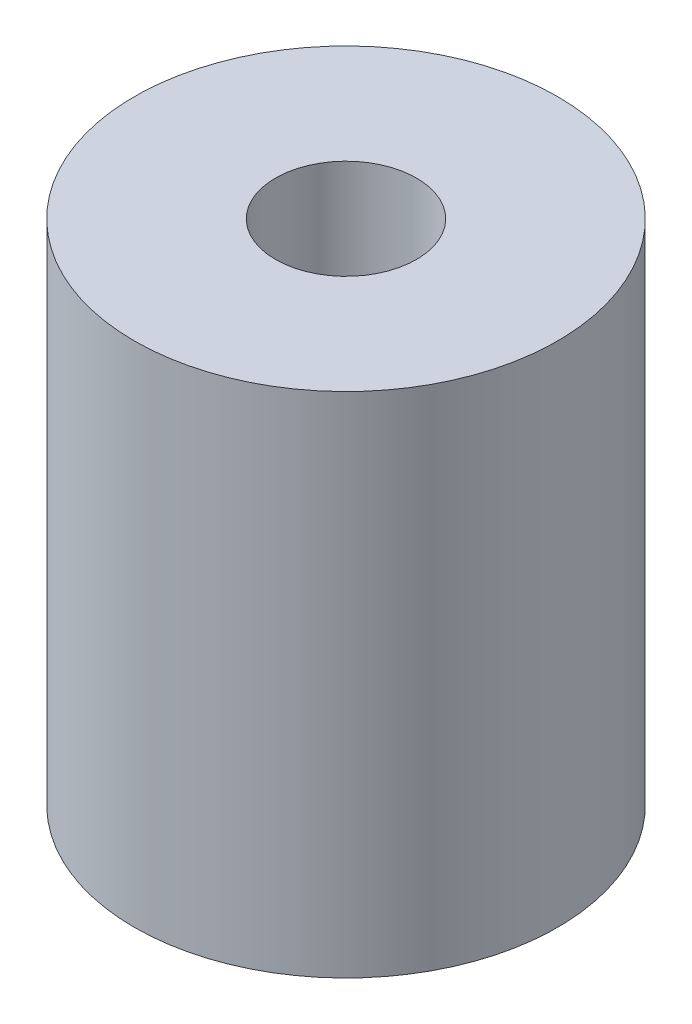
ISO-10303-21;
HEADER;
FILE_DESCRIPTION(('STEP AP214'),'2;1');
FILE_NAME('part.step','',(''),(''),'','','');
FILE_SCHEMA(('AUTOMOTIVE_DESIGN { 1 0 10303 214 1 1 1 1 }'));
ENDSEC;
DATA;
#1=APPLICATION_CONTEXT('core data for automotive mechanical design processes');
#2=APPLICATION_PROTOCOL_DEFINITION('international standard','automotive_design',2000,#1);
#3=PRODUCT_CONTEXT('',#1,'mechanical');
#4=PRODUCT('Part','Part','',(#3));
#5=PRODUCT_RELATED_PRODUCT_CATEGORY('part','',(#4));
#6=PRODUCT_DEFINITION_FORMATION('','',#4);
#7=PRODUCT_DEFINITION_CONTEXT('part definition',#1,'design');
#8=PRODUCT_DEFINITION('design','',#6,#7);
#9=PRODUCT_DEFINITION_SHAPE('','',#8);
#10=(LENGTH_UNIT() NAMED_UNIT(*) SI_UNIT(.MILLI.,.METRE.));
#11=(NAMED_UNIT(*) PLANE_ANGLE_UNIT() SI_UNIT($,.RADIAN.));
#12=(NAMED_UNIT(*) SI_UNIT($,.STERADIAN.) SOLID_ANGLE_UNIT());
#13=UNCERTAINTY_MEASURE_WITH_UNIT(LENGTH_MEASURE(1.E-05),#10,'distance_accuracy_value','');
#14=(GEOMETRIC_REPRESENTATION_CONTEXT(3) GLOBAL_UNCERTAINTY_ASSIGNED_CONTEXT((#13)) GLOBAL_UNIT_ASSIGNED_CONTEXT((#10,
#11,#12)) REPRESENTATION_CONTEXT('',''));
#15=CARTESIAN_POINT('',(0.,0.,0.));
#16=DIRECTION('',(0.,0.,1.));
#17=DIRECTION('',(1.,0.,0.));
#18=AXIS2_PLACEMENT_3D('',#15,#16,#17);
#19=CARTESIAN_POINT('',(0.,36.,0.));
#20=DIRECTION('',(0.,1.,0.));
#21=DIRECTION('',(0.,0.,1.));
#22=AXIS2_PLACEMENT_3D('',#19,#20,#21);
#23=PLANE('',#22);
#24=CARTESIAN_POINT('',(0.,36.,0.));
#25=DIRECTION('',(0.,1.,0.));
#26=DIRECTION('',(0.,0.,1.));
#27=AXIS2_PLACEMENT_3D('',#24,#25,#26);
#28=CIRCLE('',#27,15.);
#29=CARTESIAN_POINT('',(0.,36.,15.));
#30=VERTEX_POINT('',#29);
#31=EDGE_CURVE('E10',#30,#30,#28,.T.);
#32=ORIENTED_EDGE('',*,*,#31,.T.);
#33=EDGE_LOOP('',(#32));
#34=FACE_BOUND('',#33,.T.);
#35=CARTESIAN_POINT('',(0.,36.,0.));
#36=DIRECTION('',(0.,1.,0.));
#37=DIRECTION('',(0.,0.,1.));
#38=AXIS2_PLACEMENT_3D('',#35,#36,#37);
#39=CIRCLE('',#38,5.);
#40=CARTESIAN_POINT('',(0.,36.,5.));
#41=VERTEX_POINT('',#40);
#42=EDGE_CURVE('E40',#41,#41,#39,.T.);
#43=ORIENTED_EDGE('',*,*,#42,.F.);
#44=EDGE_LOOP('',(#43));
#45=FACE_BOUND('',#44,.T.);
#46=ADVANCED_FACE('F29',(#34,#45),#23,.T.);
#47=CARTESIAN_POINT('',(0.,0.,0.));
#48=DIRECTION('',(0.,1.,0.));
#49=DIRECTION('',(0.,0.,1.));
#50=AXIS2_PLACEMENT_3D('',#47,#48,#49);
#51=PLANE('',#50);
#52=CARTESIAN_POINT('',(0.,0.,0.));
#53=DIRECTION('',(0.,1.,0.));
#54=DIRECTION('',(0.,0.,1.));
#55=AXIS2_PLACEMENT_3D('',#52,#53,#54);
#56=CIRCLE('',#55,15.);
#57=CARTESIAN_POINT('',(0.,0.,15.));
#58=VERTEX_POINT('',#57);
#59=EDGE_CURVE('E33',#58,#58,#56,.T.);
#60=ORIENTED_EDGE('',*,*,#59,.F.);
#61=EDGE_LOOP('',(#60));
#62=FACE_BOUND('',#61,.T.);
#63=CARTESIAN_POINT('',(0.,0.,0.));
#64=DIRECTION('',(0.,1.,0.));
#65=DIRECTION('',(0.,0.,1.));
#66=AXIS2_PLACEMENT_3D('',#63,#64,#65);
#67=CIRCLE('',#66,5.);
#68=CARTESIAN_POINT('',(0.,0.,5.));
#69=VERTEX_POINT('',#68);
#70=EDGE_CURVE('E42',#69,#69,#67,.T.);
#71=ORIENTED_EDGE('',*,*,#70,.T.);
#72=EDGE_LOOP('',(#71));
#73=FACE_BOUND('',#72,.T.);
#74=ADVANCED_FACE('F52',(#62,#73),#51,.F.);
#75=CARTESIAN_POINT('',(0.,36.,0.));
#76=DIRECTION('',(0.,-1.,0.));
#77=DIRECTION('',(0.,0.,-1.));
#78=AXIS2_PLACEMENT_3D('',#75,#76,#77);
#79=CYLINDRICAL_SURFACE('',#78,15.);
#80=ORIENTED_EDGE('',*,*,#31,.F.);
#81=EDGE_LOOP('',(#80));
#82=FACE_BOUND('',#81,.T.);
#83=ORIENTED_EDGE('',*,*,#59,.T.);
#84=EDGE_LOOP('',(#83));
#85=FACE_BOUND('',#84,.T.);
#86=ADVANCED_FACE('F31',(#82,#85),#79,.T.);
#87=CARTESIAN_POINT('',(0.,36.,0.));
#88=DIRECTION('',(0.,-1.,0.));
#89=DIRECTION('',(0.,0.,-1.));
#90=AXIS2_PLACEMENT_3D('',#87,#88,#89);
#91=CYLINDRICAL_SURFACE('',#90,5.);
#92=ORIENTED_EDGE('',*,*,#42,.T.);
#93=EDGE_LOOP('',(#92));
#94=FACE_BOUND('',#93,.T.);
#95=ORIENTED_EDGE('',*,*,#70,.F.);
#96=EDGE_LOOP('',(#95));
#97=FACE_BOUND('',#96,.T.);
#98=ADVANCED_FACE('F48',(#94,#97),#91,.F.);
#99=CLOSED_SHELL('',(#46,#74,#86,#98));
#100=MANIFOLD_SOLID_BREP('B2',#99);
#101=ADVANCED_BREP_SHAPE_REPRESENTATION('',(#18,#100),#14);
#102=SHAPE_DEFINITION_REPRESENTATION(#9,#101);
ENDSEC;
END-ISO-10303-21;
